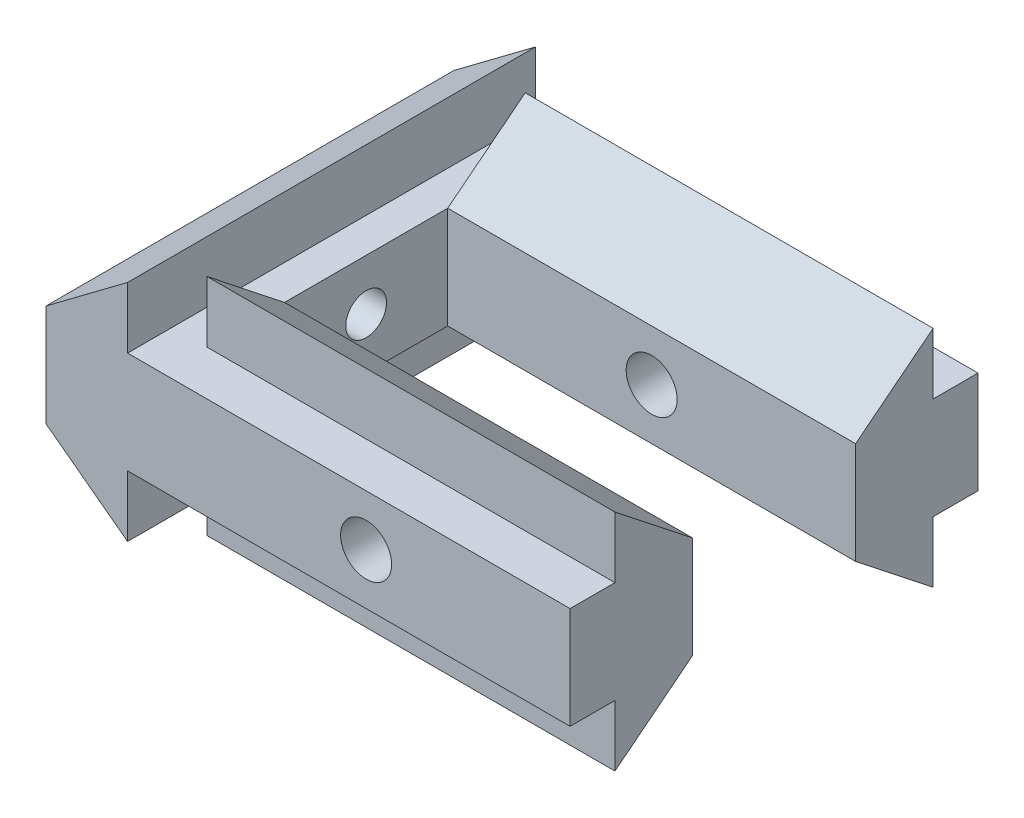
ISO-10303-21;
HEADER;
FILE_DESCRIPTION(('STEP AP214'),'2;1');
FILE_NAME('part.step','',(''),(''),'','','');
FILE_SCHEMA(('AUTOMOTIVE_DESIGN { 1 0 10303 214 1 1 1 1 }'));
ENDSEC;
DATA;
#1=APPLICATION_CONTEXT('core data for automotive mechanical design processes');
#2=APPLICATION_PROTOCOL_DEFINITION('international standard','automotive_design',2000,#1);
#3=PRODUCT_CONTEXT('',#1,'mechanical');
#4=PRODUCT('Part','Part','',(#3));
#5=PRODUCT_RELATED_PRODUCT_CATEGORY('part','',(#4));
#6=PRODUCT_DEFINITION_FORMATION('','',#4);
#7=PRODUCT_DEFINITION_CONTEXT('part definition',#1,'design');
#8=PRODUCT_DEFINITION('design','',#6,#7);
#9=PRODUCT_DEFINITION_SHAPE('','',#8);
#10=(LENGTH_UNIT() NAMED_UNIT(*) SI_UNIT(.MILLI.,.METRE.));
#11=(NAMED_UNIT(*) PLANE_ANGLE_UNIT() SI_UNIT($,.RADIAN.));
#12=(NAMED_UNIT(*) SI_UNIT($,.STERADIAN.) SOLID_ANGLE_UNIT());
#13=UNCERTAINTY_MEASURE_WITH_UNIT(LENGTH_MEASURE(1.E-05),#10,'distance_accuracy_value','');
#14=(GEOMETRIC_REPRESENTATION_CONTEXT(3) GLOBAL_UNCERTAINTY_ASSIGNED_CONTEXT((#13)) GLOBAL_UNIT_ASSIGNED_CONTEXT((#10,
#11,#12)) REPRESENTATION_CONTEXT('',''));
#15=CARTESIAN_POINT('',(0.,0.,0.));
#16=DIRECTION('',(0.,0.,1.));
#17=DIRECTION('',(1.,0.,0.));
#18=AXIS2_PLACEMENT_3D('',#15,#16,#17);
#19=CARTESIAN_POINT('',(5.69584116590784,5.,20.));
#20=DIRECTION('',(-1.,0.,0.));
#21=DIRECTION('',(0.,0.,1.));
#22=AXIS2_PLACEMENT_3D('',#19,#20,#21);
#23=PLANE('',#22);
#24=CARTESIAN_POINT('',(5.69584116590784,2.5,10.));
#25=DIRECTION('',(1.,0.,0.));
#26=DIRECTION('',(0.,0.,-1.));
#27=AXIS2_PLACEMENT_3D('',#24,#25,#26);
#28=CIRCLE('',#27,1.);
#29=CARTESIAN_POINT('',(5.69584116590784,2.5,9.));
#30=VERTEX_POINT('',#29);
#31=EDGE_CURVE('E250',#30,#30,#28,.T.);
#32=ORIENTED_EDGE('',*,*,#31,.F.);
#33=EDGE_LOOP('',(#32));
#34=FACE_BOUND('',#33,.T.);
#35=DIRECTION('',(0.,-1.,0.));
#36=VECTOR('',#35,1.);
#37=CARTESIAN_POINT('',(5.69584116590784,5.,6.));
#38=LINE('',#37,#36);
#39=CARTESIAN_POINT('',(5.69584116590784,5.,6.));
#40=VERTEX_POINT('',#39);
#41=CARTESIAN_POINT('',(5.69584116590784,0.,6.));
#42=VERTEX_POINT('',#41);
#43=EDGE_CURVE('E399',#40,#42,#38,.T.);
#44=ORIENTED_EDGE('',*,*,#43,.F.);
#45=DIRECTION('',(0.,0.,-1.));
#46=VECTOR('',#45,1.);
#47=CARTESIAN_POINT('',(5.69584116590784,5.,20.));
#48=LINE('',#47,#46);
#49=CARTESIAN_POINT('',(5.69584116590784,5.,14.));
#50=VERTEX_POINT('',#49);
#51=EDGE_CURVE('E298',#50,#40,#48,.T.);
#52=ORIENTED_EDGE('',*,*,#51,.F.);
#53=DIRECTION('',(0.,1.,0.));
#54=VECTOR('',#53,1.);
#55=CARTESIAN_POINT('',(5.69584116590784,0.,14.));
#56=LINE('',#55,#54);
#57=CARTESIAN_POINT('',(5.69584116590784,0.,14.));
#58=VERTEX_POINT('',#57);
#59=EDGE_CURVE('E231',#58,#50,#56,.T.);
#60=ORIENTED_EDGE('',*,*,#59,.F.);
#61=DIRECTION('',(0.,0.,-1.));
#62=VECTOR('',#61,1.);
#63=CARTESIAN_POINT('',(5.69584116590784,0.,20.));
#64=LINE('',#63,#62);
#65=EDGE_CURVE('E312',#58,#42,#64,.T.);
#66=ORIENTED_EDGE('',*,*,#65,.T.);
#67=EDGE_LOOP('',(#44,#52,#60,#66));
#68=FACE_BOUND('',#67,.T.);
#69=ADVANCED_FACE('F32',(#34,#68),#23,.F.);
#70=CARTESIAN_POINT('',(0.,0.,20.));
#71=DIRECTION('',(0.6,0.8,0.));
#72=DIRECTION('',(-0.8,0.6,0.));
#73=AXIS2_PLACEMENT_3D('',#70,#71,#72);
#74=PLANE('',#73);
#75=DIRECTION('',(0.8,-0.6,0.));
#76=VECTOR('',#75,1.);
#77=CARTESIAN_POINT('',(0.,0.,0.));
#78=LINE('',#77,#76);
#79=CARTESIAN_POINT('',(0.,0.,0.));
#80=VERTEX_POINT('',#79);
#81=CARTESIAN_POINT('',(4.,-3.,0.));
#82=VERTEX_POINT('',#81);
#83=EDGE_CURVE('E254',#80,#82,#78,.T.);
#84=ORIENTED_EDGE('',*,*,#83,.T.);
#85=DIRECTION('',(0.,0.,-1.));
#86=VECTOR('',#85,1.);
#87=CARTESIAN_POINT('',(4.,-3.,20.));
#88=LINE('',#87,#86);
#89=CARTESIAN_POINT('',(4.,-3.,20.));
#90=VERTEX_POINT('',#89);
#91=EDGE_CURVE('E11',#90,#82,#88,.T.);
#92=ORIENTED_EDGE('',*,*,#91,.F.);
#93=DIRECTION('',(0.8,-0.6,0.));
#94=VECTOR('',#93,1.);
#95=CARTESIAN_POINT('',(0.,0.,20.));
#96=LINE('',#95,#94);
#97=CARTESIAN_POINT('',(0.,0.,20.));
#98=VERTEX_POINT('',#97);
#99=EDGE_CURVE('E257',#98,#90,#96,.T.);
#100=ORIENTED_EDGE('',*,*,#99,.F.);
#101=DIRECTION('',(0.,0.,-1.));
#102=VECTOR('',#101,1.);
#103=CARTESIAN_POINT('',(0.,0.,20.));
#104=LINE('',#103,#102);
#105=EDGE_CURVE('E273',#98,#80,#104,.T.);
#106=ORIENTED_EDGE('',*,*,#105,.T.);
#107=EDGE_LOOP('',(#84,#92,#100,#106));
#108=FACE_BOUND('',#107,.T.);
#109=ADVANCED_FACE('F34',(#108),#74,.F.);
#110=CARTESIAN_POINT('',(4.,0.,20.));
#111=DIRECTION('',(-1.,0.,0.));
#112=DIRECTION('',(0.,0.,1.));
#113=AXIS2_PLACEMENT_3D('',#110,#111,#112);
#114=PLANE('',#113);
#115=DIRECTION('',(0.,1.,0.));
#116=VECTOR('',#115,1.);
#117=CARTESIAN_POINT('',(4.,0.,0.));
#118=LINE('',#117,#116);
#119=CARTESIAN_POINT('',(4.,0.,0.));
#120=VERTEX_POINT('',#119);
#121=EDGE_CURVE('E276',#82,#120,#118,.T.);
#122=ORIENTED_EDGE('',*,*,#121,.T.);
#123=DIRECTION('',(0.,0.,-1.));
#124=VECTOR('',#123,1.);
#125=CARTESIAN_POINT('',(4.,0.,20.));
#126=LINE('',#125,#124);
#127=CARTESIAN_POINT('',(4.,0.,20.));
#128=VERTEX_POINT('',#127);
#129=EDGE_CURVE('E41',#128,#120,#126,.T.);
#130=ORIENTED_EDGE('',*,*,#129,.F.);
#131=DIRECTION('',(0.,1.,0.));
#132=VECTOR('',#131,1.);
#133=CARTESIAN_POINT('',(4.,0.,20.));
#134=LINE('',#133,#132);
#135=EDGE_CURVE('E260',#90,#128,#134,.T.);
#136=ORIENTED_EDGE('',*,*,#135,.F.);
#137=ORIENTED_EDGE('',*,*,#91,.T.);
#138=EDGE_LOOP('',(#122,#130,#136,#137));
#139=FACE_BOUND('',#138,.T.);
#140=ADVANCED_FACE('F374',(#139),#114,.F.);
#141=CARTESIAN_POINT('',(5.69584116590784,0.,20.));
#142=DIRECTION('',(0.,1.,0.));
#143=DIRECTION('',(0.,0.,1.));
#144=AXIS2_PLACEMENT_3D('',#141,#142,#143);
#145=PLANE('',#144);
#146=DIRECTION('',(1.,0.,0.));
#147=VECTOR('',#146,1.);
#148=CARTESIAN_POINT('',(5.69584116590784,0.,0.));
#149=LINE('',#148,#147);
#150=CARTESIAN_POINT('',(25.6958411659078,0.,0.));
#151=VERTEX_POINT('',#150);
#152=EDGE_CURVE('E278',#120,#151,#149,.T.);
#153=ORIENTED_EDGE('',*,*,#152,.T.);
#154=DIRECTION('',(0.,0.,-1.));
#155=VECTOR('',#154,1.);
#156=CARTESIAN_POINT('',(25.6958411659078,0.,0.));
#157=LINE('',#156,#155);
#158=CARTESIAN_POINT('',(25.6958411659078,0.,2.2));
#159=VERTEX_POINT('',#158);
#160=EDGE_CURVE('E384',#159,#151,#157,.T.);
#161=ORIENTED_EDGE('',*,*,#160,.F.);
#162=DIRECTION('',(-1.,0.,0.));
#163=VECTOR('',#162,1.);
#164=CARTESIAN_POINT('',(25.6958411659078,0.,2.2));
#165=LINE('',#164,#163);
#166=CARTESIAN_POINT('',(5.69584116590784,0.,2.2));
#167=VERTEX_POINT('',#166);
#168=EDGE_CURVE('E411',#159,#167,#165,.T.);
#169=ORIENTED_EDGE('',*,*,#168,.T.);
#170=DIRECTION('',(0.,0.,-1.));
#171=VECTOR('',#170,1.);
#172=CARTESIAN_POINT('',(5.69584116590784,0.,20.));
#173=LINE('',#172,#171);
#174=EDGE_CURVE('E49',#42,#167,#173,.T.);
#175=ORIENTED_EDGE('',*,*,#174,.F.);
#176=ORIENTED_EDGE('',*,*,#65,.F.);
#177=CARTESIAN_POINT('',(5.69584116590784,0.,17.8));
#178=VERTEX_POINT('',#177);
#179=EDGE_CURVE('E309',#178,#58,#64,.T.);
#180=ORIENTED_EDGE('',*,*,#179,.F.);
#181=DIRECTION('',(-1.,0.,0.));
#182=VECTOR('',#181,1.);
#183=CARTESIAN_POINT('',(25.6958411659078,0.,17.8));
#184=LINE('',#183,#182);
#185=CARTESIAN_POINT('',(25.6958411659078,0.,17.8));
#186=VERTEX_POINT('',#185);
#187=EDGE_CURVE('E239',#186,#178,#184,.T.);
#188=ORIENTED_EDGE('',*,*,#187,.F.);
#189=DIRECTION('',(0.,0.,-1.));
#190=VECTOR('',#189,1.);
#191=CARTESIAN_POINT('',(25.6958411659078,0.,20.));
#192=LINE('',#191,#190);
#193=CARTESIAN_POINT('',(25.6958411659078,0.,20.));
#194=VERTEX_POINT('',#193);
#195=EDGE_CURVE('E224',#194,#186,#192,.T.);
#196=ORIENTED_EDGE('',*,*,#195,.F.);
#197=DIRECTION('',(1.,0.,0.));
#198=VECTOR('',#197,1.);
#199=CARTESIAN_POINT('',(5.69584116590784,0.,20.));
#200=LINE('',#199,#198);
#201=EDGE_CURVE('E263',#128,#194,#200,.T.);
#202=ORIENTED_EDGE('',*,*,#201,.F.);
#203=ORIENTED_EDGE('',*,*,#129,.T.);
#204=EDGE_LOOP('',(#153,#161,#169,#175,#176,#180,#188,#196,#202,#203));
#205=FACE_BOUND('',#204,.T.);
#206=ADVANCED_FACE('F348',(#205),#145,.F.);
#207=CARTESIAN_POINT('',(4.,5.,20.));
#208=DIRECTION('',(0.,-1.,0.));
#209=DIRECTION('',(0.,0.,-1.));
#210=AXIS2_PLACEMENT_3D('',#207,#208,#209);
#211=PLANE('',#210);
#212=DIRECTION('',(-1.,0.,0.));
#213=VECTOR('',#212,1.);
#214=CARTESIAN_POINT('',(4.,5.,0.));
#215=LINE('',#214,#213);
#216=CARTESIAN_POINT('',(25.6958411659078,5.,0.));
#217=VERTEX_POINT('',#216);
#218=CARTESIAN_POINT('',(4.,5.,0.));
#219=VERTEX_POINT('',#218);
#220=EDGE_CURVE('E280',#217,#219,#215,.T.);
#221=ORIENTED_EDGE('',*,*,#220,.T.);
#222=DIRECTION('',(0.,0.,-1.));
#223=VECTOR('',#222,1.);
#224=CARTESIAN_POINT('',(4.,5.,20.));
#225=LINE('',#224,#223);
#226=CARTESIAN_POINT('',(4.,5.,20.));
#227=VERTEX_POINT('',#226);
#228=EDGE_CURVE('E295',#227,#219,#225,.T.);
#229=ORIENTED_EDGE('',*,*,#228,.F.);
#230=DIRECTION('',(-1.,0.,0.));
#231=VECTOR('',#230,1.);
#232=CARTESIAN_POINT('',(4.,5.,20.));
#233=LINE('',#232,#231);
#234=CARTESIAN_POINT('',(25.6958411659078,5.,20.));
#235=VERTEX_POINT('',#234);
#236=EDGE_CURVE('E265',#235,#227,#233,.T.);
#237=ORIENTED_EDGE('',*,*,#236,.F.);
#238=DIRECTION('',(0.,0.,1.));
#239=VECTOR('',#238,1.);
#240=CARTESIAN_POINT('',(25.6958411659078,5.,17.8));
#241=LINE('',#240,#239);
#242=CARTESIAN_POINT('',(25.6958411659078,5.,17.8));
#243=VERTEX_POINT('',#242);
#244=EDGE_CURVE('E218',#243,#235,#241,.T.);
#245=ORIENTED_EDGE('',*,*,#244,.F.);
#246=DIRECTION('',(-1.,0.,0.));
#247=VECTOR('',#246,1.);
#248=CARTESIAN_POINT('',(25.6958411659078,5.,17.8));
#249=LINE('',#248,#247);
#250=CARTESIAN_POINT('',(5.69584116590784,5.,17.8));
#251=VERTEX_POINT('',#250);
#252=EDGE_CURVE('E244',#243,#251,#249,.T.);
#253=ORIENTED_EDGE('',*,*,#252,.T.);
#254=EDGE_CURVE('E305',#251,#50,#48,.T.);
#255=ORIENTED_EDGE('',*,*,#254,.T.);
#256=ORIENTED_EDGE('',*,*,#51,.T.);
#257=DIRECTION('',(0.,0.,1.));
#258=VECTOR('',#257,1.);
#259=CARTESIAN_POINT('',(5.69584116590784,5.,20.));
#260=LINE('',#259,#258);
#261=CARTESIAN_POINT('',(5.69584116590784,5.,2.2));
#262=VERTEX_POINT('',#261);
#263=EDGE_CURVE('E198',#262,#40,#260,.T.);
#264=ORIENTED_EDGE('',*,*,#263,.F.);
#265=DIRECTION('',(-1.,0.,0.));
#266=VECTOR('',#265,1.);
#267=CARTESIAN_POINT('',(25.6958411659078,5.,2.2));
#268=LINE('',#267,#266);
#269=CARTESIAN_POINT('',(25.6958411659078,5.,2.2));
#270=VERTEX_POINT('',#269);
#271=EDGE_CURVE('E408',#270,#262,#268,.T.);
#272=ORIENTED_EDGE('',*,*,#271,.F.);
#273=DIRECTION('',(0.,0.,1.));
#274=VECTOR('',#273,1.);
#275=CARTESIAN_POINT('',(25.6958411659078,5.,2.2));
#276=LINE('',#275,#274);
#277=EDGE_CURVE('E390',#217,#270,#276,.T.);
#278=ORIENTED_EDGE('',*,*,#277,.F.);
#279=EDGE_LOOP('',(#221,#229,#237,#245,#253,#255,#256,#264,#272,#278));
#280=FACE_BOUND('',#279,.T.);
#281=ADVANCED_FACE('F330',(#280),#211,.F.);
#282=CARTESIAN_POINT('',(4.,8.,20.));
#283=DIRECTION('',(-1.,0.,0.));
#284=DIRECTION('',(0.,0.,1.));
#285=AXIS2_PLACEMENT_3D('',#282,#283,#284);
#286=PLANE('',#285);
#287=DIRECTION('',(0.,1.,0.));
#288=VECTOR('',#287,1.);
#289=CARTESIAN_POINT('',(4.,8.,0.));
#290=LINE('',#289,#288);
#291=CARTESIAN_POINT('',(4.,8.,0.));
#292=VERTEX_POINT('',#291);
#293=EDGE_CURVE('E282',#219,#292,#290,.T.);
#294=ORIENTED_EDGE('',*,*,#293,.T.);
#295=DIRECTION('',(0.,0.,-1.));
#296=VECTOR('',#295,1.);
#297=CARTESIAN_POINT('',(4.,8.,20.));
#298=LINE('',#297,#296);
#299=CARTESIAN_POINT('',(4.,8.,20.));
#300=VERTEX_POINT('',#299);
#301=EDGE_CURVE('E292',#300,#292,#298,.T.);
#302=ORIENTED_EDGE('',*,*,#301,.F.);
#303=DIRECTION('',(0.,1.,0.));
#304=VECTOR('',#303,1.);
#305=CARTESIAN_POINT('',(4.,8.,20.));
#306=LINE('',#305,#304);
#307=EDGE_CURVE('E267',#227,#300,#306,.T.);
#308=ORIENTED_EDGE('',*,*,#307,.F.);
#309=ORIENTED_EDGE('',*,*,#228,.T.);
#310=EDGE_LOOP('',(#294,#302,#308,#309));
#311=FACE_BOUND('',#310,.T.);
#312=ADVANCED_FACE('F468',(#311),#286,.F.);
#313=CARTESIAN_POINT('',(0.,5.,20.));
#314=DIRECTION('',(0.6,-0.8,0.));
#315=DIRECTION('',(0.8,0.6,0.));
#316=AXIS2_PLACEMENT_3D('',#313,#314,#315);
#317=PLANE('',#316);
#318=DIRECTION('',(-0.8,-0.6,0.));
#319=VECTOR('',#318,1.);
#320=CARTESIAN_POINT('',(0.,5.,0.));
#321=LINE('',#320,#319);
#322=CARTESIAN_POINT('',(0.,5.,0.));
#323=VERTEX_POINT('',#322);
#324=EDGE_CURVE('E284',#292,#323,#321,.T.);
#325=ORIENTED_EDGE('',*,*,#324,.T.);
#326=DIRECTION('',(0.,0.,-1.));
#327=VECTOR('',#326,1.);
#328=CARTESIAN_POINT('',(0.,5.,20.));
#329=LINE('',#328,#327);
#330=CARTESIAN_POINT('',(0.,5.,20.));
#331=VERTEX_POINT('',#330);
#332=EDGE_CURVE('E289',#331,#323,#329,.T.);
#333=ORIENTED_EDGE('',*,*,#332,.F.);
#334=DIRECTION('',(-0.8,-0.6,0.));
#335=VECTOR('',#334,1.);
#336=CARTESIAN_POINT('',(0.,5.,20.));
#337=LINE('',#336,#335);
#338=EDGE_CURVE('E269',#300,#331,#337,.T.);
#339=ORIENTED_EDGE('',*,*,#338,.F.);
#340=ORIENTED_EDGE('',*,*,#301,.T.);
#341=EDGE_LOOP('',(#325,#333,#339,#340));
#342=FACE_BOUND('',#341,.T.);
#343=ADVANCED_FACE('F471',(#342),#317,.F.);
#344=CARTESIAN_POINT('',(0.,0.,20.));
#345=DIRECTION('',(1.,0.,0.));
#346=DIRECTION('',(0.,0.,-1.));
#347=AXIS2_PLACEMENT_3D('',#344,#345,#346);
#348=PLANE('',#347);
#349=CARTESIAN_POINT('',(0.,2.5,10.));
#350=DIRECTION('',(1.,0.,0.));
#351=DIRECTION('',(0.,0.,-1.));
#352=AXIS2_PLACEMENT_3D('',#349,#350,#351);
#353=CIRCLE('',#352,1.);
#354=CARTESIAN_POINT('',(0.,2.5,9.));
#355=VERTEX_POINT('',#354);
#356=EDGE_CURVE('E251',#355,#355,#353,.T.);
#357=ORIENTED_EDGE('',*,*,#356,.T.);
#358=EDGE_LOOP('',(#357));
#359=FACE_BOUND('',#358,.T.);
#360=DIRECTION('',(0.,-1.,0.));
#361=VECTOR('',#360,1.);
#362=CARTESIAN_POINT('',(0.,0.,0.));
#363=LINE('',#362,#361);
#364=EDGE_CURVE('E261',#323,#80,#363,.T.);
#365=ORIENTED_EDGE('',*,*,#364,.T.);
#366=ORIENTED_EDGE('',*,*,#105,.F.);
#367=DIRECTION('',(0.,-1.,0.));
#368=VECTOR('',#367,1.);
#369=CARTESIAN_POINT('',(0.,0.,20.));
#370=LINE('',#369,#368);
#371=EDGE_CURVE('E271',#331,#98,#370,.T.);
#372=ORIENTED_EDGE('',*,*,#371,.F.);
#373=ORIENTED_EDGE('',*,*,#332,.T.);
#374=EDGE_LOOP('',(#365,#366,#372,#373));
#375=FACE_BOUND('',#374,.T.);
#376=ADVANCED_FACE('F478',(#359,#375),#348,.F.);
#377=CARTESIAN_POINT('',(0.,0.,20.));
#378=DIRECTION('',(0.,0.,1.));
#379=DIRECTION('',(1.,0.,0.));
#380=AXIS2_PLACEMENT_3D('',#377,#378,#379);
#381=PLANE('',#380);
#382=CARTESIAN_POINT('',(15.6958411659078,2.5,20.));
#383=DIRECTION('',(0.,0.,1.));
#384=DIRECTION('',(1.,0.,0.));
#385=AXIS2_PLACEMENT_3D('',#382,#383,#384);
#386=CIRCLE('',#385,1.25);
#387=CARTESIAN_POINT('',(16.9458411659078,2.5,20.));
#388=VERTEX_POINT('',#387);
#389=EDGE_CURVE('E422',#388,#388,#386,.T.);
#390=ORIENTED_EDGE('',*,*,#389,.F.);
#391=EDGE_LOOP('',(#390));
#392=FACE_BOUND('',#391,.T.);
#393=ORIENTED_EDGE('',*,*,#99,.T.);
#394=ORIENTED_EDGE('',*,*,#135,.T.);
#395=ORIENTED_EDGE('',*,*,#201,.T.);
#396=DIRECTION('',(0.,-1.,0.));
#397=VECTOR('',#396,1.);
#398=CARTESIAN_POINT('',(25.6958411659078,5.,20.));
#399=LINE('',#398,#397);
#400=EDGE_CURVE('E221',#235,#194,#399,.T.);
#401=ORIENTED_EDGE('',*,*,#400,.F.);
#402=ORIENTED_EDGE('',*,*,#236,.T.);
#403=ORIENTED_EDGE('',*,*,#307,.T.);
#404=ORIENTED_EDGE('',*,*,#338,.T.);
#405=ORIENTED_EDGE('',*,*,#371,.T.);
#406=EDGE_LOOP('',(#393,#394,#395,#401,#402,#403,#404,#405));
#407=FACE_BOUND('',#406,.T.);
#408=ADVANCED_FACE('F370',(#392,#407),#381,.T.);
#409=CARTESIAN_POINT('',(0.,0.,0.));
#410=DIRECTION('',(0.,0.,1.));
#411=DIRECTION('',(1.,0.,0.));
#412=AXIS2_PLACEMENT_3D('',#409,#410,#411);
#413=PLANE('',#412);
#414=CARTESIAN_POINT('',(15.6958411659078,2.5,0.));
#415=DIRECTION('',(0.,0.,1.));
#416=DIRECTION('',(1.,0.,0.));
#417=AXIS2_PLACEMENT_3D('',#414,#415,#416);
#418=CIRCLE('',#417,1.25);
#419=CARTESIAN_POINT('',(16.9458411659078,2.5,0.));
#420=VERTEX_POINT('',#419);
#421=EDGE_CURVE('E425',#420,#420,#418,.T.);
#422=ORIENTED_EDGE('',*,*,#421,.T.);
#423=EDGE_LOOP('',(#422));
#424=FACE_BOUND('',#423,.T.);
#425=ORIENTED_EDGE('',*,*,#83,.F.);
#426=ORIENTED_EDGE('',*,*,#364,.F.);
#427=ORIENTED_EDGE('',*,*,#324,.F.);
#428=ORIENTED_EDGE('',*,*,#293,.F.);
#429=ORIENTED_EDGE('',*,*,#220,.F.);
#430=DIRECTION('',(0.,1.,0.));
#431=VECTOR('',#430,1.);
#432=CARTESIAN_POINT('',(25.6958411659078,5.,0.));
#433=LINE('',#432,#431);
#434=EDGE_CURVE('E381',#151,#217,#433,.T.);
#435=ORIENTED_EDGE('',*,*,#434,.F.);
#436=ORIENTED_EDGE('',*,*,#152,.F.);
#437=ORIENTED_EDGE('',*,*,#121,.F.);
#438=EDGE_LOOP('',(#425,#426,#427,#428,#429,#435,#436,#437));
#439=FACE_BOUND('',#438,.T.);
#440=ADVANCED_FACE('F377',(#424,#439),#413,.F.);
#441=CARTESIAN_POINT('',(0.,2.5,10.));
#442=DIRECTION('',(1.,0.,0.));
#443=DIRECTION('',(0.,0.,-1.));
#444=AXIS2_PLACEMENT_3D('',#441,#442,#443);
#445=CYLINDRICAL_SURFACE('',#444,1.);
#446=ORIENTED_EDGE('',*,*,#356,.F.);
#447=EDGE_LOOP('',(#446));
#448=FACE_BOUND('',#447,.T.);
#449=ORIENTED_EDGE('',*,*,#31,.T.);
#450=EDGE_LOOP('',(#449));
#451=FACE_BOUND('',#450,.T.);
#452=ADVANCED_FACE('F490',(#448,#451),#445,.F.);
#453=CARTESIAN_POINT('',(5.69584116590784,0.,0.));
#454=DIRECTION('',(1.,0.,0.));
#455=DIRECTION('',(0.,0.,-1.));
#456=AXIS2_PLACEMENT_3D('',#453,#454,#455);
#457=PLANE('',#456);
#458=DIRECTION('',(0.,-1.,0.));
#459=VECTOR('',#458,1.);
#460=CARTESIAN_POINT('',(5.69584116590784,0.,17.8));
#461=LINE('',#460,#459);
#462=CARTESIAN_POINT('',(5.69584116590784,-3.,17.8));
#463=VERTEX_POINT('',#462);
#464=EDGE_CURVE('E212',#178,#463,#461,.T.);
#465=ORIENTED_EDGE('',*,*,#464,.F.);
#466=ORIENTED_EDGE('',*,*,#179,.T.);
#467=DIRECTION('',(0.,0.619644288579021,-0.784882765533426));
#468=VECTOR('',#467,1.);
#469=CARTESIAN_POINT('',(5.69584116590784,-3.,17.8));
#470=LINE('',#469,#468);
#471=EDGE_CURVE('E207',#463,#58,#470,.T.);
#472=ORIENTED_EDGE('',*,*,#471,.F.);
#473=EDGE_LOOP('',(#465,#466,#472));
#474=FACE_BOUND('',#473,.T.);
#475=ADVANCED_FACE('F353',(#474),#457,.F.);
#476=CARTESIAN_POINT('',(25.6958411659078,-3.,17.8));
#477=DIRECTION('',(0.,0.784882765533426,0.619644288579021));
#478=DIRECTION('',(0.,-0.619644288579021,0.784882765533426));
#479=AXIS2_PLACEMENT_3D('',#476,#477,#478);
#480=PLANE('',#479);
#481=ORIENTED_EDGE('',*,*,#471,.T.);
#482=DIRECTION('',(-1.,0.,0.));
#483=VECTOR('',#482,1.);
#484=CARTESIAN_POINT('',(25.6958411659078,0.,14.));
#485=LINE('',#484,#483);
#486=CARTESIAN_POINT('',(25.6958411659078,0.,14.));
#487=VERTEX_POINT('',#486);
#488=EDGE_CURVE('E247',#487,#58,#485,.T.);
#489=ORIENTED_EDGE('',*,*,#488,.F.);
#490=DIRECTION('',(0.,0.619644288579021,-0.784882765533426));
#491=VECTOR('',#490,1.);
#492=CARTESIAN_POINT('',(25.6958411659078,-3.,17.8));
#493=LINE('',#492,#491);
#494=CARTESIAN_POINT('',(25.6958411659078,-3.,17.8));
#495=VERTEX_POINT('',#494);
#496=EDGE_CURVE('E208',#495,#487,#493,.T.);
#497=ORIENTED_EDGE('',*,*,#496,.F.);
#498=DIRECTION('',(-1.,0.,0.));
#499=VECTOR('',#498,1.);
#500=CARTESIAN_POINT('',(25.6958411659078,-3.,17.8));
#501=LINE('',#500,#499);
#502=EDGE_CURVE('E228',#495,#463,#501,.T.);
#503=ORIENTED_EDGE('',*,*,#502,.T.);
#504=EDGE_LOOP('',(#481,#489,#497,#503));
#505=FACE_BOUND('',#504,.T.);
#506=ADVANCED_FACE('F360',(#505),#480,.F.);
#507=CARTESIAN_POINT('',(25.6958411659078,0.,14.));
#508=DIRECTION('',(0.,0.,1.));
#509=DIRECTION('',(1.,0.,0.));
#510=AXIS2_PLACEMENT_3D('',#507,#508,#509);
#511=PLANE('',#510);
#512=CARTESIAN_POINT('',(15.6958411659078,2.5,14.));
#513=DIRECTION('',(0.,0.,1.));
#514=DIRECTION('',(1.,0.,0.));
#515=AXIS2_PLACEMENT_3D('',#512,#513,#514);
#516=CIRCLE('',#515,1.25);
#517=CARTESIAN_POINT('',(16.9458411659078,2.5,14.));
#518=VERTEX_POINT('',#517);
#519=EDGE_CURVE('E400',#518,#518,#516,.T.);
#520=ORIENTED_EDGE('',*,*,#519,.T.);
#521=EDGE_LOOP('',(#520));
#522=FACE_BOUND('',#521,.T.);
#523=ORIENTED_EDGE('',*,*,#59,.T.);
#524=DIRECTION('',(-1.,0.,0.));
#525=VECTOR('',#524,1.);
#526=CARTESIAN_POINT('',(25.6958411659078,5.,14.));
#527=LINE('',#526,#525);
#528=CARTESIAN_POINT('',(25.6958411659078,5.,14.));
#529=VERTEX_POINT('',#528);
#530=EDGE_CURVE('E243',#529,#50,#527,.T.);
#531=ORIENTED_EDGE('',*,*,#530,.F.);
#532=DIRECTION('',(0.,1.,0.));
#533=VECTOR('',#532,1.);
#534=CARTESIAN_POINT('',(25.6958411659078,0.,14.));
#535=LINE('',#534,#533);
#536=EDGE_CURVE('E211',#487,#529,#535,.T.);
#537=ORIENTED_EDGE('',*,*,#536,.F.);
#538=ORIENTED_EDGE('',*,*,#488,.T.);
#539=EDGE_LOOP('',(#523,#531,#537,#538));
#540=FACE_BOUND('',#539,.T.);
#541=ADVANCED_FACE('F345',(#522,#540),#511,.F.);
#542=CARTESIAN_POINT('',(25.6958411659078,5.,14.));
#543=DIRECTION('',(0.,-0.784882765533426,0.619644288579021));
#544=DIRECTION('',(0.,-0.619644288579021,-0.784882765533426));
#545=AXIS2_PLACEMENT_3D('',#542,#543,#544);
#546=PLANE('',#545);
#547=DIRECTION('',(0.,0.619644288579021,0.784882765533426));
#548=VECTOR('',#547,1.);
#549=CARTESIAN_POINT('',(5.69584116590784,5.,14.));
#550=LINE('',#549,#548);
#551=CARTESIAN_POINT('',(5.69584116590784,8.,17.8));
#552=VERTEX_POINT('',#551);
#553=EDGE_CURVE('E234',#50,#552,#550,.T.);
#554=ORIENTED_EDGE('',*,*,#553,.T.);
#555=DIRECTION('',(-1.,0.,0.));
#556=VECTOR('',#555,1.);
#557=CARTESIAN_POINT('',(25.6958411659078,8.,17.8));
#558=LINE('',#557,#556);
#559=CARTESIAN_POINT('',(25.6958411659078,8.,17.8));
#560=VERTEX_POINT('',#559);
#561=EDGE_CURVE('E240',#560,#552,#558,.T.);
#562=ORIENTED_EDGE('',*,*,#561,.F.);
#563=DIRECTION('',(0.,0.619644288579021,0.784882765533426));
#564=VECTOR('',#563,1.);
#565=CARTESIAN_POINT('',(25.6958411659078,5.,14.));
#566=LINE('',#565,#564);
#567=EDGE_CURVE('E214',#529,#560,#566,.T.);
#568=ORIENTED_EDGE('',*,*,#567,.F.);
#569=ORIENTED_EDGE('',*,*,#530,.T.);
#570=EDGE_LOOP('',(#554,#562,#568,#569));
#571=FACE_BOUND('',#570,.T.);
#572=ADVANCED_FACE('F341',(#571),#546,.F.);
#573=CARTESIAN_POINT('',(25.6958411659078,8.,17.8));
#574=DIRECTION('',(0.,0.,-1.));
#575=DIRECTION('',(-1.,0.,0.));
#576=AXIS2_PLACEMENT_3D('',#573,#574,#575);
#577=PLANE('',#576);
#578=DIRECTION('',(0.,-1.,0.));
#579=VECTOR('',#578,1.);
#580=CARTESIAN_POINT('',(5.69584116590784,8.,17.8));
#581=LINE('',#580,#579);
#582=EDGE_CURVE('E236',#552,#251,#581,.T.);
#583=ORIENTED_EDGE('',*,*,#582,.T.);
#584=ORIENTED_EDGE('',*,*,#252,.F.);
#585=DIRECTION('',(0.,-1.,0.));
#586=VECTOR('',#585,1.);
#587=CARTESIAN_POINT('',(25.6958411659078,8.,17.8));
#588=LINE('',#587,#586);
#589=EDGE_CURVE('E216',#560,#243,#588,.T.);
#590=ORIENTED_EDGE('',*,*,#589,.F.);
#591=ORIENTED_EDGE('',*,*,#561,.T.);
#592=EDGE_LOOP('',(#583,#584,#590,#591));
#593=FACE_BOUND('',#592,.T.);
#594=ADVANCED_FACE('F334',(#593),#577,.F.);
#595=CARTESIAN_POINT('',(25.6958411659078,0.,17.8));
#596=DIRECTION('',(0.,0.,-1.));
#597=DIRECTION('',(-1.,0.,0.));
#598=AXIS2_PLACEMENT_3D('',#595,#596,#597);
#599=PLANE('',#598);
#600=ORIENTED_EDGE('',*,*,#464,.T.);
#601=ORIENTED_EDGE('',*,*,#502,.F.);
#602=DIRECTION('',(0.,-1.,0.));
#603=VECTOR('',#602,1.);
#604=CARTESIAN_POINT('',(25.6958411659078,0.,17.8));
#605=LINE('',#604,#603);
#606=EDGE_CURVE('E226',#186,#495,#605,.T.);
#607=ORIENTED_EDGE('',*,*,#606,.F.);
#608=ORIENTED_EDGE('',*,*,#187,.T.);
#609=EDGE_LOOP('',(#600,#601,#607,#608));
#610=FACE_BOUND('',#609,.T.);
#611=ADVANCED_FACE('F356',(#610),#599,.F.);
#612=CARTESIAN_POINT('',(25.6958411659078,0.,0.));
#613=DIRECTION('',(1.,0.,0.));
#614=DIRECTION('',(0.,0.,-1.));
#615=AXIS2_PLACEMENT_3D('',#612,#613,#614);
#616=PLANE('',#615);
#617=ORIENTED_EDGE('',*,*,#496,.T.);
#618=ORIENTED_EDGE('',*,*,#536,.T.);
#619=ORIENTED_EDGE('',*,*,#567,.T.);
#620=ORIENTED_EDGE('',*,*,#589,.T.);
#621=ORIENTED_EDGE('',*,*,#244,.T.);
#622=ORIENTED_EDGE('',*,*,#400,.T.);
#623=ORIENTED_EDGE('',*,*,#195,.T.);
#624=ORIENTED_EDGE('',*,*,#606,.T.);
#625=EDGE_LOOP('',(#617,#618,#619,#620,#621,#622,#623,#624));
#626=FACE_BOUND('',#625,.T.);
#627=ADVANCED_FACE('F362',(#626),#616,.T.);
#628=ORIENTED_EDGE('',*,*,#254,.F.);
#629=ORIENTED_EDGE('',*,*,#582,.F.);
#630=ORIENTED_EDGE('',*,*,#553,.F.);
#631=EDGE_LOOP('',(#628,#629,#630));
#632=FACE_BOUND('',#631,.T.);
#633=ADVANCED_FACE('F339',(#632),#457,.F.);
#634=CARTESIAN_POINT('',(5.69584116590784,0.,0.));
#635=DIRECTION('',(1.,0.,0.));
#636=DIRECTION('',(0.,0.,-1.));
#637=AXIS2_PLACEMENT_3D('',#634,#635,#636);
#638=PLANE('',#637);
#639=DIRECTION('',(0.,-0.619644288579021,-0.784882765533426));
#640=VECTOR('',#639,1.);
#641=CARTESIAN_POINT('',(5.69584116590784,0.,6.));
#642=LINE('',#641,#640);
#643=CARTESIAN_POINT('',(5.69584116590784,-3.,2.2));
#644=VERTEX_POINT('',#643);
#645=EDGE_CURVE('E402',#42,#644,#642,.T.);
#646=ORIENTED_EDGE('',*,*,#645,.F.);
#647=ORIENTED_EDGE('',*,*,#174,.T.);
#648=DIRECTION('',(0.,1.,0.));
#649=VECTOR('',#648,1.);
#650=CARTESIAN_POINT('',(5.69584116590784,0.,2.2));
#651=LINE('',#650,#649);
#652=EDGE_CURVE('E404',#644,#167,#651,.T.);
#653=ORIENTED_EDGE('',*,*,#652,.F.);
#654=EDGE_LOOP('',(#646,#647,#653));
#655=FACE_BOUND('',#654,.T.);
#656=ADVANCED_FACE('F417',(#655),#638,.F.);
#657=DIRECTION('',(0.,1.,0.));
#658=VECTOR('',#657,1.);
#659=CARTESIAN_POINT('',(5.69584116590784,8.,2.2));
#660=LINE('',#659,#658);
#661=CARTESIAN_POINT('',(5.69584116590784,8.,2.2));
#662=VERTEX_POINT('',#661);
#663=EDGE_CURVE('E193',#262,#662,#660,.T.);
#664=ORIENTED_EDGE('',*,*,#663,.F.);
#665=ORIENTED_EDGE('',*,*,#263,.T.);
#666=DIRECTION('',(0.,-0.619644288579021,0.784882765533426));
#667=VECTOR('',#666,1.);
#668=CARTESIAN_POINT('',(5.69584116590784,8.,2.2));
#669=LINE('',#668,#667);
#670=EDGE_CURVE('E197',#662,#40,#669,.T.);
#671=ORIENTED_EDGE('',*,*,#670,.F.);
#672=EDGE_LOOP('',(#664,#665,#671));
#673=FACE_BOUND('',#672,.T.);
#674=ADVANCED_FACE('F584',(#673),#638,.F.);
#675=CARTESIAN_POINT('',(25.6958411659078,8.,2.2));
#676=DIRECTION('',(0.,-0.784882765533426,-0.619644288579021));
#677=DIRECTION('',(0.,0.619644288579021,-0.784882765533426));
#678=AXIS2_PLACEMENT_3D('',#675,#676,#677);
#679=PLANE('',#678);
#680=ORIENTED_EDGE('',*,*,#670,.T.);
#681=DIRECTION('',(-1.,0.,0.));
#682=VECTOR('',#681,1.);
#683=CARTESIAN_POINT('',(25.6958411659078,5.,6.));
#684=LINE('',#683,#682);
#685=CARTESIAN_POINT('',(25.6958411659078,5.,6.));
#686=VERTEX_POINT('',#685);
#687=EDGE_CURVE('E177',#686,#40,#684,.T.);
#688=ORIENTED_EDGE('',*,*,#687,.F.);
#689=DIRECTION('',(0.,-0.619644288579021,0.784882765533426));
#690=VECTOR('',#689,1.);
#691=CARTESIAN_POINT('',(25.6958411659078,8.,2.2));
#692=LINE('',#691,#690);
#693=CARTESIAN_POINT('',(25.6958411659078,8.,2.2));
#694=VERTEX_POINT('',#693);
#695=EDGE_CURVE('E184',#694,#686,#692,.T.);
#696=ORIENTED_EDGE('',*,*,#695,.F.);
#697=DIRECTION('',(-1.,0.,0.));
#698=VECTOR('',#697,1.);
#699=CARTESIAN_POINT('',(25.6958411659078,8.,2.2));
#700=LINE('',#699,#698);
#701=EDGE_CURVE('E397',#694,#662,#700,.T.);
#702=ORIENTED_EDGE('',*,*,#701,.T.);
#703=EDGE_LOOP('',(#680,#688,#696,#702));
#704=FACE_BOUND('',#703,.T.);
#705=ADVANCED_FACE('F195',(#704),#679,.F.);
#706=CARTESIAN_POINT('',(25.6958411659078,5.,6.));
#707=DIRECTION('',(0.,0.,-1.));
#708=DIRECTION('',(0.,1.,0.));
#709=AXIS2_PLACEMENT_3D('',#706,#707,#708);
#710=PLANE('',#709);
#711=CARTESIAN_POINT('',(15.6958411659078,2.5,6.));
#712=DIRECTION('',(0.,0.,-1.));
#713=DIRECTION('',(0.,1.,0.));
#714=AXIS2_PLACEMENT_3D('',#711,#712,#713);
#715=CIRCLE('',#714,1.25);
#716=CARTESIAN_POINT('',(15.6958411659078,3.75,6.));
#717=VERTEX_POINT('',#716);
#718=EDGE_CURVE('E36',#717,#717,#715,.T.);
#719=ORIENTED_EDGE('',*,*,#718,.T.);
#720=EDGE_LOOP('',(#719));
#721=FACE_BOUND('',#720,.T.);
#722=ORIENTED_EDGE('',*,*,#43,.T.);
#723=DIRECTION('',(-1.,0.,0.));
#724=VECTOR('',#723,1.);
#725=CARTESIAN_POINT('',(25.6958411659078,0.,6.));
#726=LINE('',#725,#724);
#727=CARTESIAN_POINT('',(25.6958411659078,0.,6.));
#728=VERTEX_POINT('',#727);
#729=EDGE_CURVE('E180',#728,#42,#726,.T.);
#730=ORIENTED_EDGE('',*,*,#729,.F.);
#731=DIRECTION('',(0.,-1.,0.));
#732=VECTOR('',#731,1.);
#733=CARTESIAN_POINT('',(25.6958411659078,5.,6.));
#734=LINE('',#733,#732);
#735=EDGE_CURVE('E172',#686,#728,#734,.T.);
#736=ORIENTED_EDGE('',*,*,#735,.F.);
#737=ORIENTED_EDGE('',*,*,#687,.T.);
#738=EDGE_LOOP('',(#722,#730,#736,#737));
#739=FACE_BOUND('',#738,.T.);
#740=ADVANCED_FACE('F175',(#721,#739),#710,.F.);
#741=CARTESIAN_POINT('',(25.6958411659078,0.,6.));
#742=DIRECTION('',(0.,0.784882765533426,-0.619644288579021));
#743=DIRECTION('',(0.,0.619644288579021,0.784882765533426));
#744=AXIS2_PLACEMENT_3D('',#741,#742,#743);
#745=PLANE('',#744);
#746=ORIENTED_EDGE('',*,*,#645,.T.);
#747=DIRECTION('',(-1.,0.,0.));
#748=VECTOR('',#747,1.);
#749=CARTESIAN_POINT('',(25.6958411659078,-3.,2.2));
#750=LINE('',#749,#748);
#751=CARTESIAN_POINT('',(25.6958411659078,-3.,2.2));
#752=VERTEX_POINT('',#751);
#753=EDGE_CURVE('E202',#752,#644,#750,.T.);
#754=ORIENTED_EDGE('',*,*,#753,.F.);
#755=DIRECTION('',(0.,-0.619644288579021,-0.784882765533426));
#756=VECTOR('',#755,1.);
#757=CARTESIAN_POINT('',(25.6958411659078,0.,6.));
#758=LINE('',#757,#756);
#759=EDGE_CURVE('E183',#728,#752,#758,.T.);
#760=ORIENTED_EDGE('',*,*,#759,.F.);
#761=ORIENTED_EDGE('',*,*,#729,.T.);
#762=EDGE_LOOP('',(#746,#754,#760,#761));
#763=FACE_BOUND('',#762,.T.);
#764=ADVANCED_FACE('F418',(#763),#745,.F.);
#765=CARTESIAN_POINT('',(25.6958411659078,0.,2.2));
#766=DIRECTION('',(0.,0.,1.));
#767=DIRECTION('',(0.,-1.,0.));
#768=AXIS2_PLACEMENT_3D('',#765,#766,#767);
#769=PLANE('',#768);
#770=ORIENTED_EDGE('',*,*,#652,.T.);
#771=ORIENTED_EDGE('',*,*,#168,.F.);
#772=DIRECTION('',(0.,1.,0.));
#773=VECTOR('',#772,1.);
#774=CARTESIAN_POINT('',(25.6958411659078,0.,2.2));
#775=LINE('',#774,#773);
#776=EDGE_CURVE('E387',#752,#159,#775,.T.);
#777=ORIENTED_EDGE('',*,*,#776,.F.);
#778=ORIENTED_EDGE('',*,*,#753,.T.);
#779=EDGE_LOOP('',(#770,#771,#777,#778));
#780=FACE_BOUND('',#779,.T.);
#781=ADVANCED_FACE('F415',(#780),#769,.F.);
#782=CARTESIAN_POINT('',(25.6958411659078,8.,2.2));
#783=DIRECTION('',(0.,0.,1.));
#784=DIRECTION('',(0.,-1.,0.));
#785=AXIS2_PLACEMENT_3D('',#782,#783,#784);
#786=PLANE('',#785);
#787=ORIENTED_EDGE('',*,*,#663,.T.);
#788=ORIENTED_EDGE('',*,*,#701,.F.);
#789=DIRECTION('',(0.,1.,0.));
#790=VECTOR('',#789,1.);
#791=CARTESIAN_POINT('',(25.6958411659078,8.,2.2));
#792=LINE('',#791,#790);
#793=EDGE_CURVE('E189',#270,#694,#792,.T.);
#794=ORIENTED_EDGE('',*,*,#793,.F.);
#795=ORIENTED_EDGE('',*,*,#271,.T.);
#796=EDGE_LOOP('',(#787,#788,#794,#795));
#797=FACE_BOUND('',#796,.T.);
#798=ADVANCED_FACE('F443',(#797),#786,.F.);
#799=CARTESIAN_POINT('',(25.6958411659078,0.,0.));
#800=DIRECTION('',(1.,0.,0.));
#801=DIRECTION('',(0.,0.,-1.));
#802=AXIS2_PLACEMENT_3D('',#799,#800,#801);
#803=PLANE('',#802);
#804=ORIENTED_EDGE('',*,*,#695,.T.);
#805=ORIENTED_EDGE('',*,*,#735,.T.);
#806=ORIENTED_EDGE('',*,*,#759,.T.);
#807=ORIENTED_EDGE('',*,*,#776,.T.);
#808=ORIENTED_EDGE('',*,*,#160,.T.);
#809=ORIENTED_EDGE('',*,*,#434,.T.);
#810=ORIENTED_EDGE('',*,*,#277,.T.);
#811=ORIENTED_EDGE('',*,*,#793,.T.);
#812=EDGE_LOOP('',(#804,#805,#806,#807,#808,#809,#810,#811));
#813=FACE_BOUND('',#812,.T.);
#814=ADVANCED_FACE('F187',(#813),#803,.T.);
#815=CARTESIAN_POINT('',(15.6958411659078,2.5,0.));
#816=DIRECTION('',(0.,0.,1.));
#817=DIRECTION('',(1.,0.,0.));
#818=AXIS2_PLACEMENT_3D('',#815,#816,#817);
#819=CYLINDRICAL_SURFACE('',#818,1.25);
#820=ORIENTED_EDGE('',*,*,#421,.F.);
#821=EDGE_LOOP('',(#820));
#822=FACE_BOUND('',#821,.T.);
#823=ORIENTED_EDGE('',*,*,#718,.F.);
#824=EDGE_LOOP('',(#823));
#825=FACE_BOUND('',#824,.T.);
#826=ADVANCED_FACE('F433',(#822,#825),#819,.F.);
#827=ORIENTED_EDGE('',*,*,#389,.T.);
#828=EDGE_LOOP('',(#827));
#829=FACE_BOUND('',#828,.T.);
#830=ORIENTED_EDGE('',*,*,#519,.F.);
#831=EDGE_LOOP('',(#830));
#832=FACE_BOUND('',#831,.T.);
#833=ADVANCED_FACE('F435',(#829,#832),#819,.F.);
#834=CLOSED_SHELL('',(#69,#109,#140,#206,#281,#312,#343,#376,#408,#440,#452,#475,#506,#541,#572,
#594,#611,#627,#633,#656,#674,#705,#740,#764,#781,#798,#814,#826,#833));
#835=MANIFOLD_SOLID_BREP('B2',#834);
#836=ADVANCED_BREP_SHAPE_REPRESENTATION('',(#18,#835),#14);
#837=SHAPE_DEFINITION_REPRESENTATION(#9,#836);
ENDSEC;
END-ISO-10303-21;
